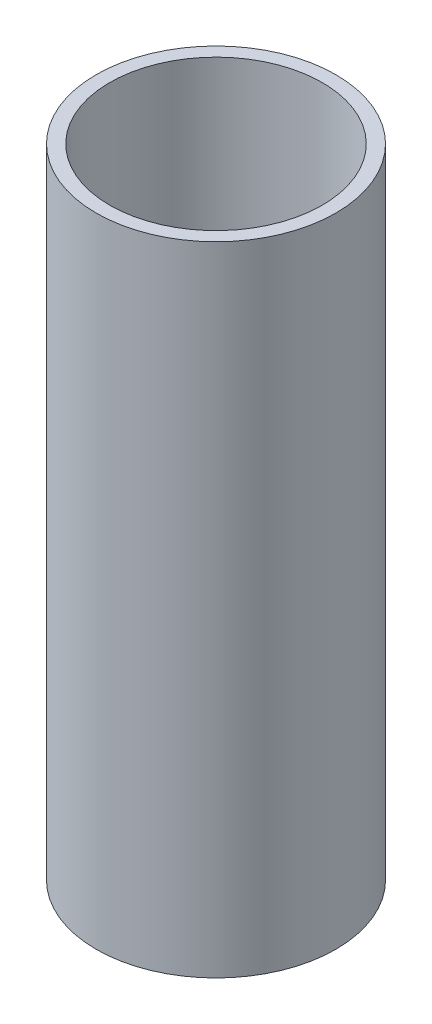
ISO-10303-21;
HEADER;
FILE_DESCRIPTION(('STEP AP214'),'2;1');
FILE_NAME('part.step','',(''),(''),'','','');
FILE_SCHEMA(('AUTOMOTIVE_DESIGN { 1 0 10303 214 1 1 1 1 }'));
ENDSEC;
DATA;
#1=APPLICATION_CONTEXT('core data for automotive mechanical design processes');
#2=APPLICATION_PROTOCOL_DEFINITION('international standard','automotive_design',2000,#1);
#3=PRODUCT_CONTEXT('',#1,'mechanical');
#4=PRODUCT('Part','Part','',(#3));
#5=PRODUCT_RELATED_PRODUCT_CATEGORY('part','',(#4));
#6=PRODUCT_DEFINITION_FORMATION('','',#4);
#7=PRODUCT_DEFINITION_CONTEXT('part definition',#1,'design');
#8=PRODUCT_DEFINITION('design','',#6,#7);
#9=PRODUCT_DEFINITION_SHAPE('','',#8);
#10=(LENGTH_UNIT() NAMED_UNIT(*) SI_UNIT(.MILLI.,.METRE.));
#11=(NAMED_UNIT(*) PLANE_ANGLE_UNIT() SI_UNIT($,.RADIAN.));
#12=(NAMED_UNIT(*) SI_UNIT($,.STERADIAN.) SOLID_ANGLE_UNIT());
#13=UNCERTAINTY_MEASURE_WITH_UNIT(LENGTH_MEASURE(1.E-05),#10,'distance_accuracy_value','');
#14=(GEOMETRIC_REPRESENTATION_CONTEXT(3) GLOBAL_UNCERTAINTY_ASSIGNED_CONTEXT((#13)) GLOBAL_UNIT_ASSIGNED_CONTEXT((#10,
#11,#12)) REPRESENTATION_CONTEXT('',''));
#15=CARTESIAN_POINT('',(0.,0.,0.));
#16=DIRECTION('',(0.,0.,1.));
#17=DIRECTION('',(1.,0.,0.));
#18=AXIS2_PLACEMENT_3D('',#15,#16,#17);
#19=CARTESIAN_POINT('',(0.,19.05,0.));
#20=DIRECTION('',(0.,1.,0.));
#21=DIRECTION('',(0.,0.,1.));
#22=AXIS2_PLACEMENT_3D('',#19,#20,#21);
#23=PLANE('',#22);
#24=CARTESIAN_POINT('',(0.,19.05,0.));
#25=DIRECTION('',(0.,1.,0.));
#26=DIRECTION('',(0.,0.,1.));
#27=AXIS2_PLACEMENT_3D('',#24,#25,#26);
#28=CIRCLE('',#27,3.5814);
#29=CARTESIAN_POINT('',(0.,19.05,3.5814));
#30=VERTEX_POINT('',#29);
#31=EDGE_CURVE('E10',#30,#30,#28,.T.);
#32=ORIENTED_EDGE('',*,*,#31,.T.);
#33=EDGE_LOOP('',(#32));
#34=FACE_BOUND('',#33,.T.);
#35=CARTESIAN_POINT('',(0.,19.05,0.));
#36=DIRECTION('',(0.,1.,0.));
#37=DIRECTION('',(0.,0.,1.));
#38=AXIS2_PLACEMENT_3D('',#35,#36,#37);
#39=CIRCLE('',#38,3.175);
#40=CARTESIAN_POINT('',(0.,19.05,3.175));
#41=VERTEX_POINT('',#40);
#42=EDGE_CURVE('E369',#41,#41,#39,.T.);
#43=ORIENTED_EDGE('',*,*,#42,.F.);
#44=EDGE_LOOP('',(#43));
#45=FACE_BOUND('',#44,.T.);
#46=ADVANCED_FACE('F358',(#34,#45),#23,.T.);
#47=CARTESIAN_POINT('',(0.,0.,0.));
#48=DIRECTION('',(0.,1.,0.));
#49=DIRECTION('',(0.,0.,1.));
#50=AXIS2_PLACEMENT_3D('',#47,#48,#49);
#51=PLANE('',#50);
#52=CARTESIAN_POINT('',(0.,0.,0.));
#53=DIRECTION('',(0.,1.,0.));
#54=DIRECTION('',(0.,0.,1.));
#55=AXIS2_PLACEMENT_3D('',#52,#53,#54);
#56=CIRCLE('',#55,3.5814);
#57=CARTESIAN_POINT('',(0.,0.,3.5814));
#58=VERTEX_POINT('',#57);
#59=EDGE_CURVE('E365',#58,#58,#56,.T.);
#60=ORIENTED_EDGE('',*,*,#59,.F.);
#61=EDGE_LOOP('',(#60));
#62=FACE_BOUND('',#61,.T.);
#63=CARTESIAN_POINT('',(0.,0.,0.));
#64=DIRECTION('',(0.,1.,0.));
#65=DIRECTION('',(0.,0.,1.));
#66=AXIS2_PLACEMENT_3D('',#63,#64,#65);
#67=CIRCLE('',#66,3.175);
#68=CARTESIAN_POINT('',(0.,0.,3.175));
#69=VERTEX_POINT('',#68);
#70=EDGE_CURVE('E373',#69,#69,#67,.T.);
#71=ORIENTED_EDGE('',*,*,#70,.T.);
#72=EDGE_LOOP('',(#71));
#73=FACE_BOUND('',#72,.T.);
#74=ADVANCED_FACE('F379',(#62,#73),#51,.F.);
#75=CARTESIAN_POINT('',(0.,19.05,0.));
#76=DIRECTION('',(0.,-1.,0.));
#77=DIRECTION('',(0.,0.,-1.));
#78=AXIS2_PLACEMENT_3D('',#75,#76,#77);
#79=CYLINDRICAL_SURFACE('',#78,3.5814);
#80=ORIENTED_EDGE('',*,*,#31,.F.);
#81=EDGE_LOOP('',(#80));
#82=FACE_BOUND('',#81,.T.);
#83=ORIENTED_EDGE('',*,*,#59,.T.);
#84=EDGE_LOOP('',(#83));
#85=FACE_BOUND('',#84,.T.);
#86=ADVANCED_FACE('F360',(#82,#85),#79,.T.);
#87=CARTESIAN_POINT('',(0.,19.05,0.));
#88=DIRECTION('',(0.,-1.,0.));
#89=DIRECTION('',(0.,0.,-1.));
#90=AXIS2_PLACEMENT_3D('',#87,#88,#89);
#91=CYLINDRICAL_SURFACE('',#90,3.175);
#92=ORIENTED_EDGE('',*,*,#42,.T.);
#93=EDGE_LOOP('',(#92));
#94=FACE_BOUND('',#93,.T.);
#95=ORIENTED_EDGE('',*,*,#70,.F.);
#96=EDGE_LOOP('',(#95));
#97=FACE_BOUND('',#96,.T.);
#98=ADVANCED_FACE('F381',(#94,#97),#91,.F.);
#99=CLOSED_SHELL('',(#46,#74,#86,#98));
#100=MANIFOLD_SOLID_BREP('B2',#99);
#101=ADVANCED_BREP_SHAPE_REPRESENTATION('',(#18,#100),#14);
#102=SHAPE_DEFINITION_REPRESENTATION(#9,#101);
ENDSEC;
END-ISO-10303-21;
